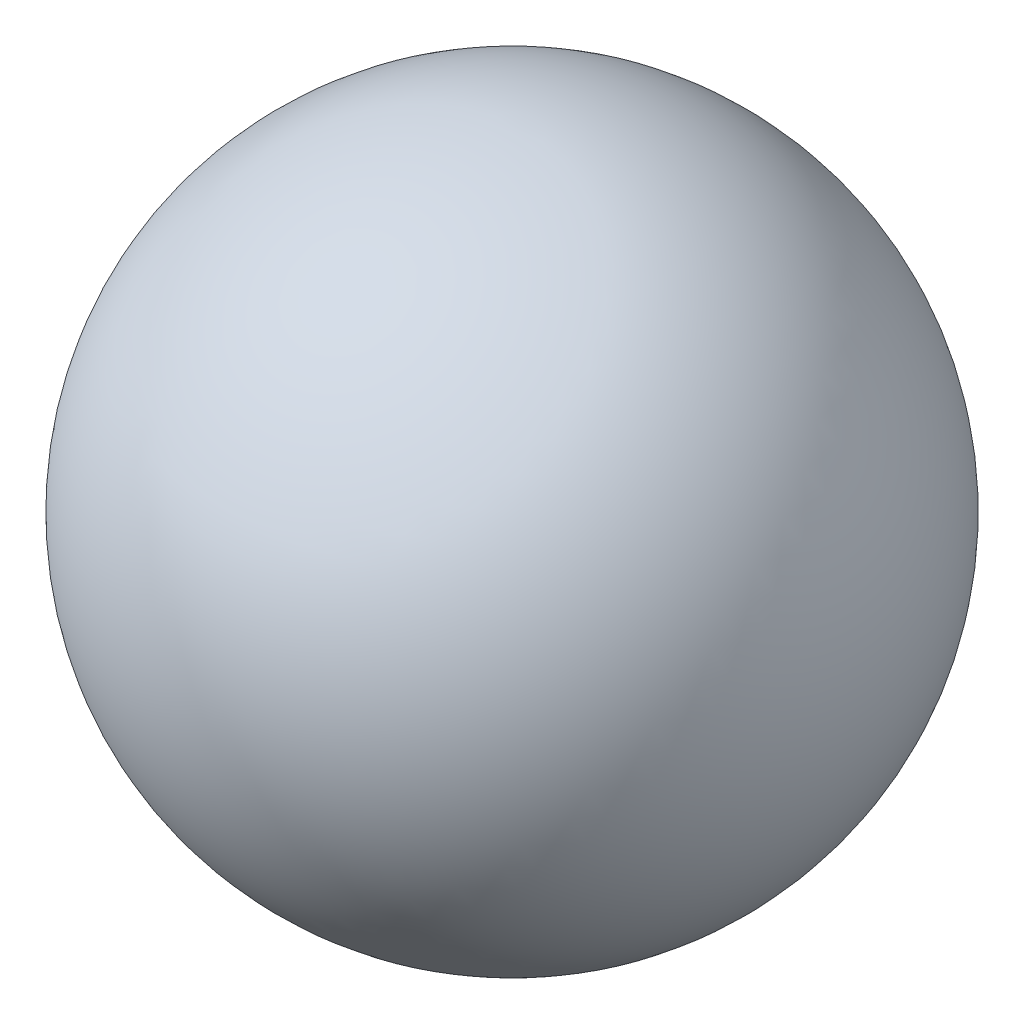
ISO-10303-21;
HEADER;
FILE_DESCRIPTION(('STEP AP214'),'2;1');
FILE_NAME('part.step','',(''),(''),'','','');
FILE_SCHEMA(('AUTOMOTIVE_DESIGN { 1 0 10303 214 1 1 1 1 }'));
ENDSEC;
DATA;
#1=APPLICATION_CONTEXT('core data for automotive mechanical design processes');
#2=APPLICATION_PROTOCOL_DEFINITION('international standard','automotive_design',2000,#1);
#3=PRODUCT_CONTEXT('',#1,'mechanical');
#4=PRODUCT('Part','Part','',(#3));
#5=PRODUCT_RELATED_PRODUCT_CATEGORY('part','',(#4));
#6=PRODUCT_DEFINITION_FORMATION('','',#4);
#7=PRODUCT_DEFINITION_CONTEXT('part definition',#1,'design');
#8=PRODUCT_DEFINITION('design','',#6,#7);
#9=PRODUCT_DEFINITION_SHAPE('','',#8);
#10=(LENGTH_UNIT() NAMED_UNIT(*) SI_UNIT(.MILLI.,.METRE.));
#11=(NAMED_UNIT(*) PLANE_ANGLE_UNIT() SI_UNIT($,.RADIAN.));
#12=(NAMED_UNIT(*) SI_UNIT($,.STERADIAN.) SOLID_ANGLE_UNIT());
#13=UNCERTAINTY_MEASURE_WITH_UNIT(LENGTH_MEASURE(1.E-05),#10,'distance_accuracy_value','');
#14=(GEOMETRIC_REPRESENTATION_CONTEXT(3) GLOBAL_UNCERTAINTY_ASSIGNED_CONTEXT((#13)) GLOBAL_UNIT_ASSIGNED_CONTEXT((#10,
#11,#12)) REPRESENTATION_CONTEXT('',''));
#15=CARTESIAN_POINT('',(0.,0.,0.));
#16=DIRECTION('',(0.,0.,1.));
#17=DIRECTION('',(1.,0.,0.));
#18=AXIS2_PLACEMENT_3D('',#15,#16,#17);
#19=CARTESIAN_POINT('',(0.,0.,0.));
#20=DIRECTION('',(0.,1.,0.));
#21=DIRECTION('',(1.,0.,0.));
#22=AXIS2_PLACEMENT_3D('',#19,#20,#21);
#23=SPHERICAL_SURFACE('',#22,510.);
#24=CARTESIAN_POINT('',(0.,510.,0.));
#25=VERTEX_POINT('',#24);
#26=VERTEX_LOOP('',#25);
#27=FACE_BOUND('',#26,.T.);
#28=ADVANCED_FACE('F33',(#27),#23,.T.);
#29=CLOSED_SHELL('',(#28));
#30=MANIFOLD_SOLID_BREP('B2',#29);
#31=ADVANCED_BREP_SHAPE_REPRESENTATION('',(#18,#30),#14);
#32=SHAPE_DEFINITION_REPRESENTATION(#9,#31);
ENDSEC;
END-ISO-10303-21;
